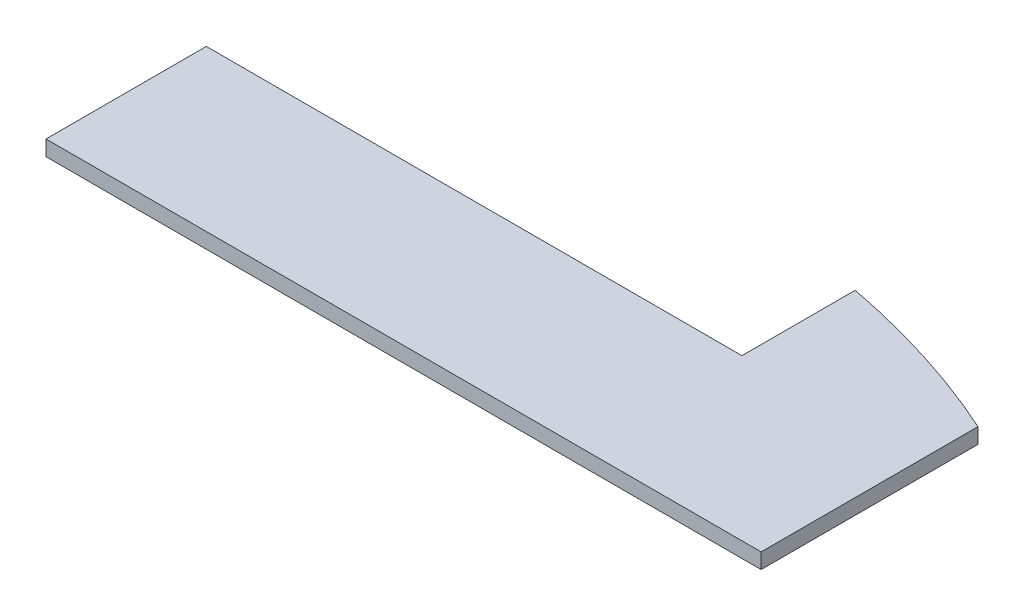
ISO-10303-21;
HEADER;
FILE_DESCRIPTION(('STEP AP214'),'2;1');
FILE_NAME('part.step','',(''),(''),'','','');
FILE_SCHEMA(('AUTOMOTIVE_DESIGN { 1 0 10303 214 1 1 1 1 }'));
ENDSEC;
DATA;
#1=APPLICATION_CONTEXT('core data for automotive mechanical design processes');
#2=APPLICATION_PROTOCOL_DEFINITION('international standard','automotive_design',2000,#1);
#3=PRODUCT_CONTEXT('',#1,'mechanical');
#4=PRODUCT('Part','Part','',(#3));
#5=PRODUCT_RELATED_PRODUCT_CATEGORY('part','',(#4));
#6=PRODUCT_DEFINITION_FORMATION('','',#4);
#7=PRODUCT_DEFINITION_CONTEXT('part definition',#1,'design');
#8=PRODUCT_DEFINITION('design','',#6,#7);
#9=PRODUCT_DEFINITION_SHAPE('','',#8);
#10=(LENGTH_UNIT() NAMED_UNIT(*) SI_UNIT(.MILLI.,.METRE.));
#11=(NAMED_UNIT(*) PLANE_ANGLE_UNIT() SI_UNIT($,.RADIAN.));
#12=(NAMED_UNIT(*) SI_UNIT($,.STERADIAN.) SOLID_ANGLE_UNIT());
#13=UNCERTAINTY_MEASURE_WITH_UNIT(LENGTH_MEASURE(1.E-05),#10,'distance_accuracy_value','');
#14=(GEOMETRIC_REPRESENTATION_CONTEXT(3) GLOBAL_UNCERTAINTY_ASSIGNED_CONTEXT((#13)) GLOBAL_UNIT_ASSIGNED_CONTEXT((#10,
#11,#12)) REPRESENTATION_CONTEXT('',''));
#15=CARTESIAN_POINT('',(0.,0.,0.));
#16=DIRECTION('',(0.,0.,1.));
#17=DIRECTION('',(1.,0.,0.));
#18=AXIS2_PLACEMENT_3D('',#15,#16,#17);
#19=CARTESIAN_POINT('',(0.,1.6,-16.6999999999904));
#20=DIRECTION('',(1.,0.,0.));
#21=DIRECTION('',(0.,0.,-1.));
#22=AXIS2_PLACEMENT_3D('',#19,#20,#21);
#23=PLANE('',#22);
#24=DIRECTION('',(0.,0.,1.));
#25=VECTOR('',#24,1.);
#26=CARTESIAN_POINT('',(0.,0.,-16.6999999999904));
#27=LINE('',#26,#25);
#28=CARTESIAN_POINT('',(0.,0.,-16.6999999999904));
#29=VERTEX_POINT('',#28);
#30=CARTESIAN_POINT('',(0.,0.,0.));
#31=VERTEX_POINT('',#30);
#32=EDGE_CURVE('E119',#29,#31,#27,.T.);
#33=ORIENTED_EDGE('',*,*,#32,.T.);
#34=DIRECTION('',(0.,-1.,0.));
#35=VECTOR('',#34,1.);
#36=CARTESIAN_POINT('',(0.,1.6,0.));
#37=LINE('',#36,#35);
#38=CARTESIAN_POINT('',(0.,1.6,0.));
#39=VERTEX_POINT('',#38);
#40=EDGE_CURVE('E11',#39,#31,#37,.T.);
#41=ORIENTED_EDGE('',*,*,#40,.F.);
#42=DIRECTION('',(0.,0.,1.));
#43=VECTOR('',#42,1.);
#44=CARTESIAN_POINT('',(0.,1.6,-16.6999999999904));
#45=LINE('',#44,#43);
#46=CARTESIAN_POINT('',(0.,1.6,-16.6999999999904));
#47=VERTEX_POINT('',#46);
#48=EDGE_CURVE('E129',#47,#39,#45,.T.);
#49=ORIENTED_EDGE('',*,*,#48,.F.);
#50=DIRECTION('',(0.,-1.,0.));
#51=VECTOR('',#50,1.);
#52=CARTESIAN_POINT('',(0.,1.6,-16.6999999999904));
#53=LINE('',#52,#51);
#54=EDGE_CURVE('E114',#47,#29,#53,.T.);
#55=ORIENTED_EDGE('',*,*,#54,.T.);
#56=EDGE_LOOP('',(#33,#41,#49,#55));
#57=FACE_BOUND('',#56,.T.);
#58=ADVANCED_FACE('F34',(#57),#23,.F.);
#59=CARTESIAN_POINT('',(0.,1.6,0.));
#60=DIRECTION('',(0.,0.,-1.));
#61=DIRECTION('',(-1.,0.,0.));
#62=AXIS2_PLACEMENT_3D('',#59,#60,#61);
#63=PLANE('',#62);
#64=DIRECTION('',(1.,0.,0.));
#65=VECTOR('',#64,1.);
#66=CARTESIAN_POINT('',(0.,0.,0.));
#67=LINE('',#66,#65);
#68=CARTESIAN_POINT('',(74.5,0.,0.));
#69=VERTEX_POINT('',#68);
#70=EDGE_CURVE('E122',#31,#69,#67,.T.);
#71=ORIENTED_EDGE('',*,*,#70,.T.);
#72=DIRECTION('',(0.,-1.,0.));
#73=VECTOR('',#72,1.);
#74=CARTESIAN_POINT('',(74.5,1.6,0.));
#75=LINE('',#74,#73);
#76=CARTESIAN_POINT('',(74.5,1.6,0.));
#77=VERTEX_POINT('',#76);
#78=EDGE_CURVE('E42',#77,#69,#75,.T.);
#79=ORIENTED_EDGE('',*,*,#78,.F.);
#80=DIRECTION('',(1.,0.,0.));
#81=VECTOR('',#80,1.);
#82=CARTESIAN_POINT('',(0.,1.6,0.));
#83=LINE('',#82,#81);
#84=EDGE_CURVE('E87',#39,#77,#83,.T.);
#85=ORIENTED_EDGE('',*,*,#84,.F.);
#86=ORIENTED_EDGE('',*,*,#40,.T.);
#87=EDGE_LOOP('',(#71,#79,#85,#86));
#88=FACE_BOUND('',#87,.T.);
#89=ADVANCED_FACE('F153',(#88),#63,.F.);
#90=CARTESIAN_POINT('',(74.5,1.6,0.));
#91=DIRECTION('',(-1.,0.,0.));
#92=DIRECTION('',(0.,0.,1.));
#93=AXIS2_PLACEMENT_3D('',#90,#91,#92);
#94=PLANE('',#93);
#95=DIRECTION('',(0.,0.,-1.));
#96=VECTOR('',#95,1.);
#97=CARTESIAN_POINT('',(74.5,0.,0.));
#98=LINE('',#97,#96);
#99=CARTESIAN_POINT('',(74.5,0.,-22.5920937520438));
#100=VERTEX_POINT('',#99);
#101=EDGE_CURVE('E124',#69,#100,#98,.T.);
#102=ORIENTED_EDGE('',*,*,#101,.T.);
#103=DIRECTION('',(0.,-1.,0.));
#104=VECTOR('',#103,1.);
#105=CARTESIAN_POINT('',(74.5,1.6,-22.5920937520438));
#106=LINE('',#105,#104);
#107=CARTESIAN_POINT('',(74.5,1.6,-22.5920937520438));
#108=VERTEX_POINT('',#107);
#109=EDGE_CURVE('E109',#108,#100,#106,.T.);
#110=ORIENTED_EDGE('',*,*,#109,.F.);
#111=DIRECTION('',(0.,0.,-1.));
#112=VECTOR('',#111,1.);
#113=CARTESIAN_POINT('',(74.5,1.6,0.));
#114=LINE('',#113,#112);
#115=EDGE_CURVE('E100',#77,#108,#114,.T.);
#116=ORIENTED_EDGE('',*,*,#115,.F.);
#117=ORIENTED_EDGE('',*,*,#78,.T.);
#118=EDGE_LOOP('',(#102,#110,#116,#117));
#119=FACE_BOUND('',#118,.T.);
#120=ADVANCED_FACE('F135',(#119),#94,.F.);
#121=CARTESIAN_POINT('',(39.7282237246851,1.6,35.));
#122=DIRECTION('',(0.,1.,0.));
#123=DIRECTION('',(-1.,0.,0.));
#124=AXIS2_PLACEMENT_3D('',#121,#122,#123);
#125=ELLIPSE('',#124,75.,65.);
#126=DIRECTION('',(0.,-1.,0.));
#127=VECTOR('',#126,1.);
#128=SURFACE_OF_LINEAR_EXTRUSION('',#125,#127);
#129=CARTESIAN_POINT('',(39.7282237246851,0.,35.));
#130=DIRECTION('',(0.,1.,0.));
#131=DIRECTION('',(-1.,0.,0.));
#132=AXIS2_PLACEMENT_3D('',#129,#130,#131);
#133=ELLIPSE('',#132,75.,65.);
#134=CARTESIAN_POINT('',(55.8000000000003,0.,-28.4900504276309));
#135=VERTEX_POINT('',#134);
#136=EDGE_CURVE('E108',#100,#135,#133,.T.);
#137=ORIENTED_EDGE('',*,*,#136,.T.);
#138=DIRECTION('',(0.,-1.,0.));
#139=VECTOR('',#138,1.);
#140=CARTESIAN_POINT('',(55.8000000000003,1.6,-28.4900504276309));
#141=LINE('',#140,#139);
#142=CARTESIAN_POINT('',(55.8000000000003,1.6,-28.4900504276309));
#143=VERTEX_POINT('',#142);
#144=EDGE_CURVE('E105',#143,#135,#141,.T.);
#145=ORIENTED_EDGE('',*,*,#144,.F.);
#146=EDGE_CURVE('E94',#108,#143,#125,.T.);
#147=ORIENTED_EDGE('',*,*,#146,.F.);
#148=ORIENTED_EDGE('',*,*,#109,.T.);
#149=EDGE_LOOP('',(#137,#145,#147,#148));
#150=FACE_BOUND('',#149,.T.);
#151=ADVANCED_FACE('F106',(#150),#128,.F.);
#152=CARTESIAN_POINT('',(55.8000000000003,1.6,-28.4900504276309));
#153=DIRECTION('',(1.,0.,0.));
#154=DIRECTION('',(0.,0.,-1.));
#155=AXIS2_PLACEMENT_3D('',#152,#153,#154);
#156=PLANE('',#155);
#157=DIRECTION('',(0.,0.,1.));
#158=VECTOR('',#157,1.);
#159=CARTESIAN_POINT('',(55.8000000000003,0.,-28.4900504276309));
#160=LINE('',#159,#158);
#161=CARTESIAN_POINT('',(55.8000000000003,0.,-16.6999999999904));
#162=VERTEX_POINT('',#161);
#163=EDGE_CURVE('E73',#135,#162,#160,.T.);
#164=ORIENTED_EDGE('',*,*,#163,.T.);
#165=DIRECTION('',(0.,-1.,0.));
#166=VECTOR('',#165,1.);
#167=CARTESIAN_POINT('',(55.8000000000003,1.6,-16.6999999999904));
#168=LINE('',#167,#166);
#169=CARTESIAN_POINT('',(55.8000000000003,1.6,-16.6999999999904));
#170=VERTEX_POINT('',#169);
#171=EDGE_CURVE('E110',#170,#162,#168,.T.);
#172=ORIENTED_EDGE('',*,*,#171,.F.);
#173=DIRECTION('',(0.,0.,1.));
#174=VECTOR('',#173,1.);
#175=CARTESIAN_POINT('',(55.8000000000003,1.6,-28.4900504276309));
#176=LINE('',#175,#174);
#177=EDGE_CURVE('E98',#143,#170,#176,.T.);
#178=ORIENTED_EDGE('',*,*,#177,.F.);
#179=ORIENTED_EDGE('',*,*,#144,.T.);
#180=EDGE_LOOP('',(#164,#172,#178,#179));
#181=FACE_BOUND('',#180,.T.);
#182=ADVANCED_FACE('F112',(#181),#156,.F.);
#183=CARTESIAN_POINT('',(55.8000000000003,1.6,-16.6999999999904));
#184=DIRECTION('',(0.,0.,1.));
#185=DIRECTION('',(1.,0.,0.));
#186=AXIS2_PLACEMENT_3D('',#183,#184,#185);
#187=PLANE('',#186);
#188=DIRECTION('',(-1.,0.,0.));
#189=VECTOR('',#188,1.);
#190=CARTESIAN_POINT('',(55.8000000000003,0.,-16.6999999999904));
#191=LINE('',#190,#189);
#192=EDGE_CURVE('E79',#162,#29,#191,.T.);
#193=ORIENTED_EDGE('',*,*,#192,.T.);
#194=ORIENTED_EDGE('',*,*,#54,.F.);
#195=DIRECTION('',(-1.,0.,0.));
#196=VECTOR('',#195,1.);
#197=CARTESIAN_POINT('',(55.8000000000003,1.6,-16.6999999999904));
#198=LINE('',#197,#196);
#199=EDGE_CURVE('E50',#170,#47,#198,.T.);
#200=ORIENTED_EDGE('',*,*,#199,.F.);
#201=ORIENTED_EDGE('',*,*,#171,.T.);
#202=EDGE_LOOP('',(#193,#194,#200,#201));
#203=FACE_BOUND('',#202,.T.);
#204=ADVANCED_FACE('F142',(#203),#187,.F.);
#205=CARTESIAN_POINT('',(39.7282237246851,1.6,35.));
#206=DIRECTION('',(0.,1.,0.));
#207=DIRECTION('',(0.,0.,1.));
#208=AXIS2_PLACEMENT_3D('',#205,#206,#207);
#209=PLANE('',#208);
#210=ORIENTED_EDGE('',*,*,#48,.T.);
#211=ORIENTED_EDGE('',*,*,#84,.T.);
#212=ORIENTED_EDGE('',*,*,#115,.T.);
#213=ORIENTED_EDGE('',*,*,#146,.T.);
#214=ORIENTED_EDGE('',*,*,#177,.T.);
#215=ORIENTED_EDGE('',*,*,#199,.T.);
#216=EDGE_LOOP('',(#210,#211,#212,#213,#214,#215));
#217=FACE_BOUND('',#216,.T.);
#218=ADVANCED_FACE('F96',(#217),#209,.T.);
#219=CARTESIAN_POINT('',(39.7282237246851,0.,35.));
#220=DIRECTION('',(0.,1.,0.));
#221=DIRECTION('',(0.,0.,1.));
#222=AXIS2_PLACEMENT_3D('',#219,#220,#221);
#223=PLANE('',#222);
#224=ORIENTED_EDGE('',*,*,#32,.F.);
#225=ORIENTED_EDGE('',*,*,#192,.F.);
#226=ORIENTED_EDGE('',*,*,#163,.F.);
#227=ORIENTED_EDGE('',*,*,#136,.F.);
#228=ORIENTED_EDGE('',*,*,#101,.F.);
#229=ORIENTED_EDGE('',*,*,#70,.F.);
#230=EDGE_LOOP('',(#224,#225,#226,#227,#228,#229));
#231=FACE_BOUND('',#230,.T.);
#232=ADVANCED_FACE('F138',(#231),#223,.F.);
#233=CLOSED_SHELL('',(#58,#89,#120,#151,#182,#204,#218,#232));
#234=MANIFOLD_SOLID_BREP('B2',#233);
#235=ADVANCED_BREP_SHAPE_REPRESENTATION('',(#18,#234),#14);
#236=SHAPE_DEFINITION_REPRESENTATION(#9,#235);
ENDSEC;
END-ISO-10303-21;
